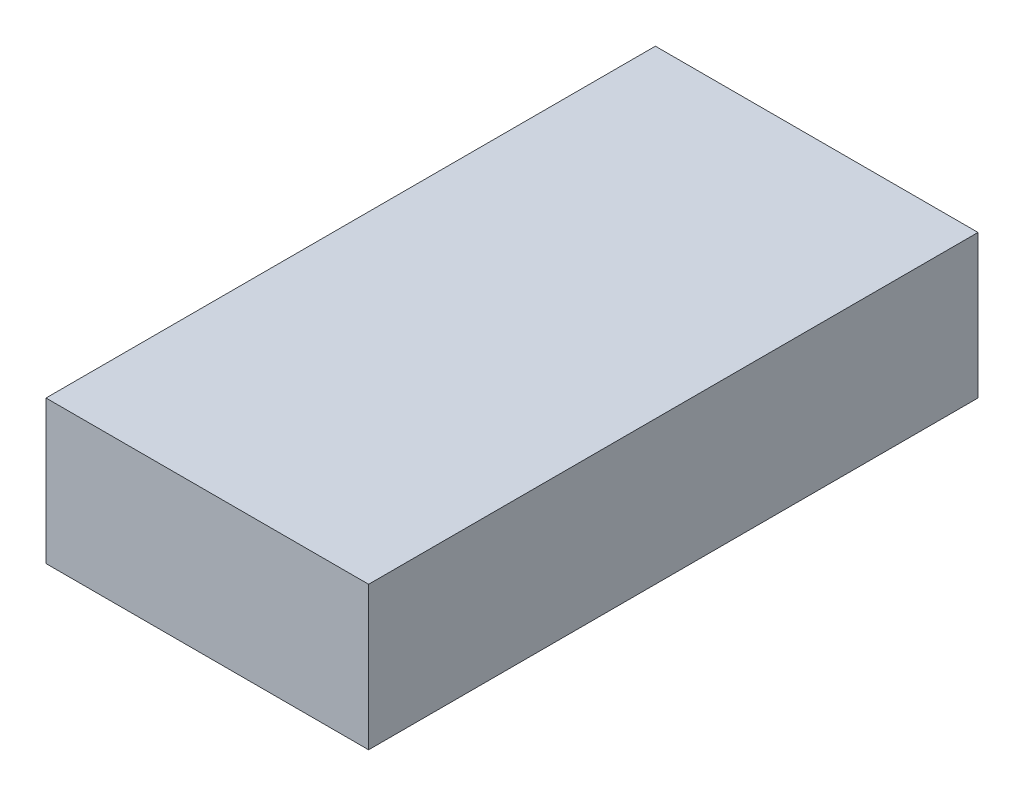
ISO-10303-21;
HEADER;
FILE_DESCRIPTION(('STEP AP214'),'2;1');
FILE_NAME('part.step','',(''),(''),'','','');
FILE_SCHEMA(('AUTOMOTIVE_DESIGN { 1 0 10303 214 1 1 1 1 }'));
ENDSEC;
DATA;
#1=APPLICATION_CONTEXT('core data for automotive mechanical design processes');
#2=APPLICATION_PROTOCOL_DEFINITION('international standard','automotive_design',2000,#1);
#3=PRODUCT_CONTEXT('',#1,'mechanical');
#4=PRODUCT('Part','Part','',(#3));
#5=PRODUCT_RELATED_PRODUCT_CATEGORY('part','',(#4));
#6=PRODUCT_DEFINITION_FORMATION('','',#4);
#7=PRODUCT_DEFINITION_CONTEXT('part definition',#1,'design');
#8=PRODUCT_DEFINITION('design','',#6,#7);
#9=PRODUCT_DEFINITION_SHAPE('','',#8);
#10=(LENGTH_UNIT() NAMED_UNIT(*) SI_UNIT(.MILLI.,.METRE.));
#11=(NAMED_UNIT(*) PLANE_ANGLE_UNIT() SI_UNIT($,.RADIAN.));
#12=(NAMED_UNIT(*) SI_UNIT($,.STERADIAN.) SOLID_ANGLE_UNIT());
#13=UNCERTAINTY_MEASURE_WITH_UNIT(LENGTH_MEASURE(1.E-05),#10,'distance_accuracy_value','');
#14=(GEOMETRIC_REPRESENTATION_CONTEXT(3) GLOBAL_UNCERTAINTY_ASSIGNED_CONTEXT((#13)) GLOBAL_UNIT_ASSIGNED_CONTEXT((#10,
#11,#12)) REPRESENTATION_CONTEXT('',''));
#15=CARTESIAN_POINT('',(0.,0.,0.));
#16=DIRECTION('',(0.,0.,1.));
#17=DIRECTION('',(1.,0.,0.));
#18=AXIS2_PLACEMENT_3D('',#15,#16,#17);
#19=CARTESIAN_POINT('',(18.000000052,16.,34.));
#20=DIRECTION('',(-1.,0.,0.));
#21=DIRECTION('',(0.,0.,1.));
#22=AXIS2_PLACEMENT_3D('',#19,#20,#21);
#23=PLANE('',#22);
#24=DIRECTION('',(0.,0.,-1.));
#25=VECTOR('',#24,1.);
#26=CARTESIAN_POINT('',(18.000000052,0.,34.));
#27=LINE('',#26,#25);
#28=CARTESIAN_POINT('',(18.000000052,0.,34.));
#29=VERTEX_POINT('',#28);
#30=CARTESIAN_POINT('',(18.000000052,0.,-34.));
#31=VERTEX_POINT('',#30);
#32=EDGE_CURVE('E96',#29,#31,#27,.T.);
#33=ORIENTED_EDGE('',*,*,#32,.T.);
#34=DIRECTION('',(0.,-1.,0.));
#35=VECTOR('',#34,1.);
#36=CARTESIAN_POINT('',(18.000000052,16.,-34.));
#37=LINE('',#36,#35);
#38=CARTESIAN_POINT('',(18.000000052,16.,-34.));
#39=VERTEX_POINT('',#38);
#40=EDGE_CURVE('E11',#39,#31,#37,.T.);
#41=ORIENTED_EDGE('',*,*,#40,.F.);
#42=DIRECTION('',(0.,0.,-1.));
#43=VECTOR('',#42,1.);
#44=CARTESIAN_POINT('',(18.000000052,16.,34.));
#45=LINE('',#44,#43);
#46=CARTESIAN_POINT('',(18.000000052,16.,34.));
#47=VERTEX_POINT('',#46);
#48=EDGE_CURVE('E84',#47,#39,#45,.T.);
#49=ORIENTED_EDGE('',*,*,#48,.F.);
#50=DIRECTION('',(0.,-1.,0.));
#51=VECTOR('',#50,1.);
#52=CARTESIAN_POINT('',(18.000000052,16.,34.));
#53=LINE('',#52,#51);
#54=EDGE_CURVE('E92',#47,#29,#53,.T.);
#55=ORIENTED_EDGE('',*,*,#54,.T.);
#56=EDGE_LOOP('',(#33,#41,#49,#55));
#57=FACE_BOUND('',#56,.T.);
#58=ADVANCED_FACE('F33',(#57),#23,.F.);
#59=CARTESIAN_POINT('',(-18.000000052,16.,-34.));
#60=DIRECTION('',(0.,0.,1.));
#61=DIRECTION('',(1.,0.,0.));
#62=AXIS2_PLACEMENT_3D('',#59,#60,#61);
#63=PLANE('',#62);
#64=DIRECTION('',(-1.,0.,0.));
#65=VECTOR('',#64,1.);
#66=CARTESIAN_POINT('',(-18.000000052,0.,-34.));
#67=LINE('',#66,#65);
#68=CARTESIAN_POINT('',(-18.000000052,0.,-34.));
#69=VERTEX_POINT('',#68);
#70=EDGE_CURVE('E88',#31,#69,#67,.T.);
#71=ORIENTED_EDGE('',*,*,#70,.T.);
#72=DIRECTION('',(0.,-1.,0.));
#73=VECTOR('',#72,1.);
#74=CARTESIAN_POINT('',(-18.000000052,16.,-34.));
#75=LINE('',#74,#73);
#76=CARTESIAN_POINT('',(-18.000000052,16.,-34.));
#77=VERTEX_POINT('',#76);
#78=EDGE_CURVE('E41',#77,#69,#75,.T.);
#79=ORIENTED_EDGE('',*,*,#78,.F.);
#80=DIRECTION('',(-1.,0.,0.));
#81=VECTOR('',#80,1.);
#82=CARTESIAN_POINT('',(-18.000000052,16.,-34.));
#83=LINE('',#82,#81);
#84=EDGE_CURVE('E79',#39,#77,#83,.T.);
#85=ORIENTED_EDGE('',*,*,#84,.F.);
#86=ORIENTED_EDGE('',*,*,#40,.T.);
#87=EDGE_LOOP('',(#71,#79,#85,#86));
#88=FACE_BOUND('',#87,.T.);
#89=ADVANCED_FACE('F87',(#88),#63,.F.);
#90=CARTESIAN_POINT('',(-18.000000052,16.,34.));
#91=DIRECTION('',(1.,0.,0.));
#92=DIRECTION('',(0.,0.,-1.));
#93=AXIS2_PLACEMENT_3D('',#90,#91,#92);
#94=PLANE('',#93);
#95=DIRECTION('',(0.,0.,1.));
#96=VECTOR('',#95,1.);
#97=CARTESIAN_POINT('',(-18.000000052,0.,34.));
#98=LINE('',#97,#96);
#99=CARTESIAN_POINT('',(-18.000000052,0.,34.));
#100=VERTEX_POINT('',#99);
#101=EDGE_CURVE('E66',#69,#100,#98,.T.);
#102=ORIENTED_EDGE('',*,*,#101,.T.);
#103=DIRECTION('',(0.,-1.,0.));
#104=VECTOR('',#103,1.);
#105=CARTESIAN_POINT('',(-18.000000052,16.,34.));
#106=LINE('',#105,#104);
#107=CARTESIAN_POINT('',(-18.000000052,16.,34.));
#108=VERTEX_POINT('',#107);
#109=EDGE_CURVE('E89',#108,#100,#106,.T.);
#110=ORIENTED_EDGE('',*,*,#109,.F.);
#111=DIRECTION('',(0.,0.,1.));
#112=VECTOR('',#111,1.);
#113=CARTESIAN_POINT('',(-18.000000052,16.,34.));
#114=LINE('',#113,#112);
#115=EDGE_CURVE('E82',#77,#108,#114,.T.);
#116=ORIENTED_EDGE('',*,*,#115,.F.);
#117=ORIENTED_EDGE('',*,*,#78,.T.);
#118=EDGE_LOOP('',(#102,#110,#116,#117));
#119=FACE_BOUND('',#118,.T.);
#120=ADVANCED_FACE('F90',(#119),#94,.F.);
#121=CARTESIAN_POINT('',(-18.000000052,16.,34.));
#122=DIRECTION('',(0.,0.,-1.));
#123=DIRECTION('',(-1.,0.,0.));
#124=AXIS2_PLACEMENT_3D('',#121,#122,#123);
#125=PLANE('',#124);
#126=DIRECTION('',(1.,0.,0.));
#127=VECTOR('',#126,1.);
#128=CARTESIAN_POINT('',(-18.000000052,0.,34.));
#129=LINE('',#128,#127);
#130=EDGE_CURVE('E72',#100,#29,#129,.T.);
#131=ORIENTED_EDGE('',*,*,#130,.T.);
#132=ORIENTED_EDGE('',*,*,#54,.F.);
#133=DIRECTION('',(1.,0.,0.));
#134=VECTOR('',#133,1.);
#135=CARTESIAN_POINT('',(-18.000000052,16.,34.));
#136=LINE('',#135,#134);
#137=EDGE_CURVE('E49',#108,#47,#136,.T.);
#138=ORIENTED_EDGE('',*,*,#137,.F.);
#139=ORIENTED_EDGE('',*,*,#109,.T.);
#140=EDGE_LOOP('',(#131,#132,#138,#139));
#141=FACE_BOUND('',#140,.T.);
#142=ADVANCED_FACE('F103',(#141),#125,.F.);
#143=CARTESIAN_POINT('',(18.000000052,16.,-34.));
#144=DIRECTION('',(0.,-1.,0.));
#145=DIRECTION('',(0.,0.,-1.));
#146=AXIS2_PLACEMENT_3D('',#143,#144,#145);
#147=PLANE('',#146);
#148=ORIENTED_EDGE('',*,*,#48,.T.);
#149=ORIENTED_EDGE('',*,*,#84,.T.);
#150=ORIENTED_EDGE('',*,*,#115,.T.);
#151=ORIENTED_EDGE('',*,*,#137,.T.);
#152=EDGE_LOOP('',(#148,#149,#150,#151));
#153=FACE_BOUND('',#152,.T.);
#154=ADVANCED_FACE('F80',(#153),#147,.F.);
#155=CARTESIAN_POINT('',(18.000000052,0.,-34.));
#156=DIRECTION('',(0.,-1.,0.));
#157=DIRECTION('',(0.,0.,-1.));
#158=AXIS2_PLACEMENT_3D('',#155,#156,#157);
#159=PLANE('',#158);
#160=ORIENTED_EDGE('',*,*,#32,.F.);
#161=ORIENTED_EDGE('',*,*,#130,.F.);
#162=ORIENTED_EDGE('',*,*,#101,.F.);
#163=ORIENTED_EDGE('',*,*,#70,.F.);
#164=EDGE_LOOP('',(#160,#161,#162,#163));
#165=FACE_BOUND('',#164,.T.);
#166=ADVANCED_FACE('F106',(#165),#159,.T.);
#167=CLOSED_SHELL('',(#58,#89,#120,#142,#154,#166));
#168=MANIFOLD_SOLID_BREP('B2',#167);
#169=ADVANCED_BREP_SHAPE_REPRESENTATION('',(#18,#168),#14);
#170=SHAPE_DEFINITION_REPRESENTATION(#9,#169);
ENDSEC;
END-ISO-10303-21;
